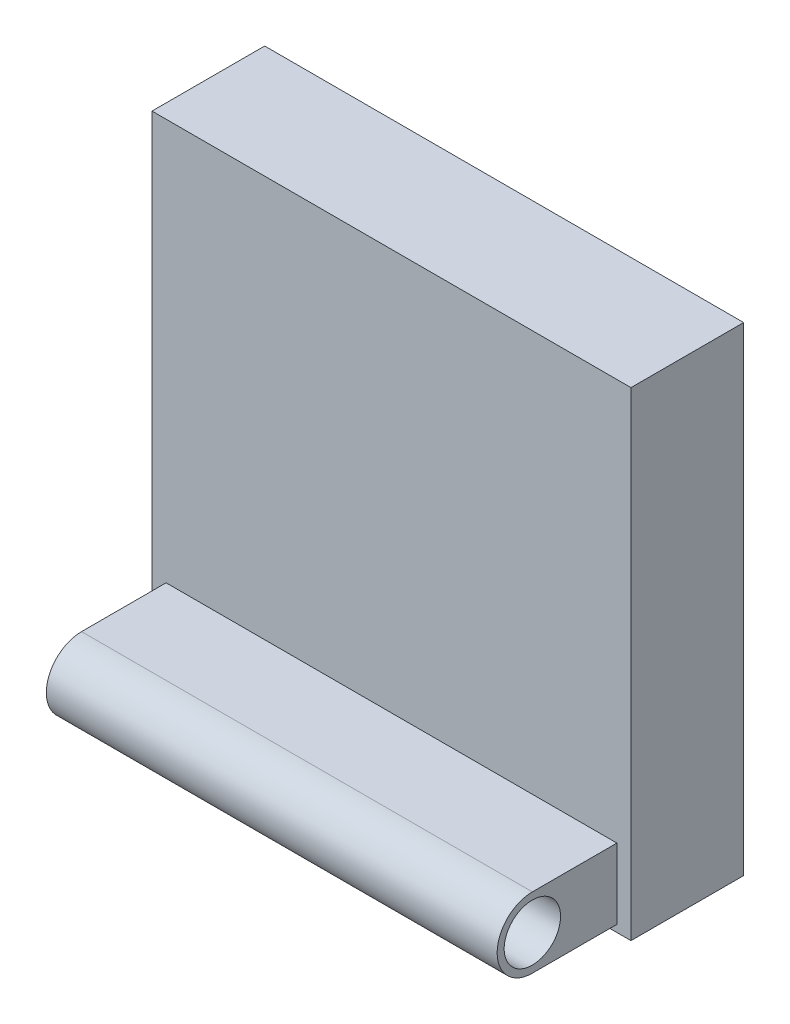
ISO-10303-21;
HEADER;
FILE_DESCRIPTION(('STEP AP214'),'2;1');
FILE_NAME('part.step','',(''),(''),'','','');
FILE_SCHEMA(('AUTOMOTIVE_DESIGN { 1 0 10303 214 1 1 1 1 }'));
ENDSEC;
DATA;
#1=APPLICATION_CONTEXT('core data for automotive mechanical design processes');
#2=APPLICATION_PROTOCOL_DEFINITION('international standard','automotive_design',2000,#1);
#3=PRODUCT_CONTEXT('',#1,'mechanical');
#4=PRODUCT('Part','Part','',(#3));
#5=PRODUCT_RELATED_PRODUCT_CATEGORY('part','',(#4));
#6=PRODUCT_DEFINITION_FORMATION('','',#4);
#7=PRODUCT_DEFINITION_CONTEXT('part definition',#1,'design');
#8=PRODUCT_DEFINITION('design','',#6,#7);
#9=PRODUCT_DEFINITION_SHAPE('','',#8);
#10=(LENGTH_UNIT() NAMED_UNIT(*) SI_UNIT(.MILLI.,.METRE.));
#11=(NAMED_UNIT(*) PLANE_ANGLE_UNIT() SI_UNIT($,.RADIAN.));
#12=(NAMED_UNIT(*) SI_UNIT($,.STERADIAN.) SOLID_ANGLE_UNIT());
#13=UNCERTAINTY_MEASURE_WITH_UNIT(LENGTH_MEASURE(1.E-05),#10,'distance_accuracy_value','');
#14=(GEOMETRIC_REPRESENTATION_CONTEXT(3) GLOBAL_UNCERTAINTY_ASSIGNED_CONTEXT((#13)) GLOBAL_UNIT_ASSIGNED_CONTEXT((#10,
#11,#12)) REPRESENTATION_CONTEXT('',''));
#15=CARTESIAN_POINT('',(0.,0.,0.));
#16=DIRECTION('',(0.,0.,1.));
#17=DIRECTION('',(1.,0.,0.));
#18=AXIS2_PLACEMENT_3D('',#15,#16,#17);
#19=CARTESIAN_POINT('',(0.,0.,8.));
#20=DIRECTION('',(0.,0.,0.999999999999999));
#21=DIRECTION('',(1.,0.,0.));
#22=AXIS2_PLACEMENT_3D('',#19,#20,#21);
#23=PLANE('',#22);
#24=DIRECTION('',(1.,0.,0.));
#25=VECTOR('',#24,1.);
#26=CARTESIAN_POINT('',(0.,34.,8.));
#27=LINE('',#26,#25);
#28=CARTESIAN_POINT('',(0.,34.,8.));
#29=VERTEX_POINT('',#28);
#30=CARTESIAN_POINT('',(34.,34.,8.));
#31=VERTEX_POINT('',#30);
#32=EDGE_CURVE('E155',#29,#31,#27,.T.);
#33=ORIENTED_EDGE('',*,*,#32,.F.);
#34=DIRECTION('',(0.,0.999999999999999,0.));
#35=VECTOR('',#34,1.);
#36=CARTESIAN_POINT('',(0.,0.,8.));
#37=LINE('',#36,#35);
#38=CARTESIAN_POINT('',(0.,0.,8.));
#39=VERTEX_POINT('',#38);
#40=EDGE_CURVE('E161',#39,#29,#37,.T.);
#41=ORIENTED_EDGE('',*,*,#40,.F.);
#42=DIRECTION('',(1.,0.,0.));
#43=VECTOR('',#42,1.);
#44=CARTESIAN_POINT('',(0.,0.,8.));
#45=LINE('',#44,#43);
#46=CARTESIAN_POINT('',(34.,0.,8.));
#47=VERTEX_POINT('',#46);
#48=EDGE_CURVE('E159',#39,#47,#45,.T.);
#49=ORIENTED_EDGE('',*,*,#48,.T.);
#50=DIRECTION('',(0.,0.999999999999999,0.));
#51=VECTOR('',#50,1.);
#52=CARTESIAN_POINT('',(34.,0.,8.));
#53=LINE('',#52,#51);
#54=EDGE_CURVE('E100',#47,#31,#53,.T.);
#55=ORIENTED_EDGE('',*,*,#54,.T.);
#56=EDGE_LOOP('',(#33,#41,#49,#55));
#57=FACE_BOUND('',#56,.T.);
#58=DIRECTION('',(0.,0.999999999999999,0.));
#59=VECTOR('',#58,1.);
#60=CARTESIAN_POINT('',(1.,5.5,8.));
#61=LINE('',#60,#59);
#62=CARTESIAN_POINT('',(1.,0.500000000000003,8.));
#63=VERTEX_POINT('',#62);
#64=CARTESIAN_POINT('',(1.,5.5,8.));
#65=VERTEX_POINT('',#64);
#66=EDGE_CURVE('E67',#63,#65,#61,.T.);
#67=ORIENTED_EDGE('',*,*,#66,.T.);
#68=DIRECTION('',(-1.,0.,0.));
#69=VECTOR('',#68,1.);
#70=CARTESIAN_POINT('',(33.,5.5,8.));
#71=LINE('',#70,#69);
#72=CARTESIAN_POINT('',(33.,5.5,8.));
#73=VERTEX_POINT('',#72);
#74=EDGE_CURVE('E128',#73,#65,#71,.T.);
#75=ORIENTED_EDGE('',*,*,#74,.F.);
#76=DIRECTION('',(0.,0.999999999999999,0.));
#77=VECTOR('',#76,1.);
#78=CARTESIAN_POINT('',(33.,5.5,8.));
#79=LINE('',#78,#77);
#80=CARTESIAN_POINT('',(33.,0.5,8.));
#81=VERTEX_POINT('',#80);
#82=EDGE_CURVE('E134',#81,#73,#79,.T.);
#83=ORIENTED_EDGE('',*,*,#82,.F.);
#84=DIRECTION('',(-1.,0.,0.));
#85=VECTOR('',#84,1.);
#86=CARTESIAN_POINT('',(33.,0.5,8.));
#87=LINE('',#86,#85);
#88=EDGE_CURVE('E261',#81,#63,#87,.T.);
#89=ORIENTED_EDGE('',*,*,#88,.T.);
#90=EDGE_LOOP('',(#67,#75,#83,#89));
#91=FACE_BOUND('',#90,.T.);
#92=ADVANCED_FACE('F50',(#57,#91),#23,.T.);
#93=CARTESIAN_POINT('',(0.,34.,8.));
#94=DIRECTION('',(0.,0.999999999999999,0.));
#95=DIRECTION('',(0.,0.,0.999999999999999));
#96=AXIS2_PLACEMENT_3D('',#93,#94,#95);
#97=PLANE('',#96);
#98=DIRECTION('',(1.,0.,0.));
#99=VECTOR('',#98,1.);
#100=CARTESIAN_POINT('',(0.,34.,0.));
#101=LINE('',#100,#99);
#102=CARTESIAN_POINT('',(0.,34.,0.));
#103=VERTEX_POINT('',#102);
#104=CARTESIAN_POINT('',(34.,34.,0.));
#105=VERTEX_POINT('',#104);
#106=EDGE_CURVE('E146',#103,#105,#101,.T.);
#107=ORIENTED_EDGE('',*,*,#106,.F.);
#108=DIRECTION('',(0.,0.,-0.999999999999999));
#109=VECTOR('',#108,1.);
#110=CARTESIAN_POINT('',(0.,34.,8.));
#111=LINE('',#110,#109);
#112=EDGE_CURVE('E13',#29,#103,#111,.T.);
#113=ORIENTED_EDGE('',*,*,#112,.F.);
#114=ORIENTED_EDGE('',*,*,#32,.T.);
#115=DIRECTION('',(0.,0.,-0.999999999999999));
#116=VECTOR('',#115,1.);
#117=CARTESIAN_POINT('',(34.,34.,8.));
#118=LINE('',#117,#116);
#119=EDGE_CURVE('E54',#31,#105,#118,.T.);
#120=ORIENTED_EDGE('',*,*,#119,.T.);
#121=EDGE_LOOP('',(#107,#113,#114,#120));
#122=FACE_BOUND('',#121,.T.);
#123=ADVANCED_FACE('F52',(#122),#97,.T.);
#124=CARTESIAN_POINT('',(0.,0.,8.));
#125=DIRECTION('',(-1.,0.,0.));
#126=DIRECTION('',(0.,-0.999999999999999,0.));
#127=AXIS2_PLACEMENT_3D('',#124,#125,#126);
#128=PLANE('',#127);
#129=DIRECTION('',(0.,0.999999999999999,0.));
#130=VECTOR('',#129,1.);
#131=CARTESIAN_POINT('',(0.,0.,0.));
#132=LINE('',#131,#130);
#133=CARTESIAN_POINT('',(0.,0.,0.));
#134=VERTEX_POINT('',#133);
#135=EDGE_CURVE('E157',#134,#103,#132,.T.);
#136=ORIENTED_EDGE('',*,*,#135,.F.);
#137=DIRECTION('',(0.,0.,-0.999999999999999));
#138=VECTOR('',#137,1.);
#139=CARTESIAN_POINT('',(0.,0.,8.));
#140=LINE('',#139,#138);
#141=EDGE_CURVE('E59',#39,#134,#140,.T.);
#142=ORIENTED_EDGE('',*,*,#141,.F.);
#143=ORIENTED_EDGE('',*,*,#40,.T.);
#144=ORIENTED_EDGE('',*,*,#112,.T.);
#145=EDGE_LOOP('',(#136,#142,#143,#144));
#146=FACE_BOUND('',#145,.T.);
#147=ADVANCED_FACE('F178',(#146),#128,.T.);
#148=CARTESIAN_POINT('',(0.,0.,8.));
#149=DIRECTION('',(0.,0.999999999999999,0.));
#150=DIRECTION('',(0.,0.,0.999999999999999));
#151=AXIS2_PLACEMENT_3D('',#148,#149,#150);
#152=PLANE('',#151);
#153=DIRECTION('',(1.,0.,0.));
#154=VECTOR('',#153,1.);
#155=CARTESIAN_POINT('',(0.,0.,0.));
#156=LINE('',#155,#154);
#157=CARTESIAN_POINT('',(34.,0.,0.));
#158=VERTEX_POINT('',#157);
#159=EDGE_CURVE('E165',#134,#158,#156,.T.);
#160=ORIENTED_EDGE('',*,*,#159,.T.);
#161=DIRECTION('',(0.,0.,-0.999999999999999));
#162=VECTOR('',#161,1.);
#163=CARTESIAN_POINT('',(34.,0.,8.));
#164=LINE('',#163,#162);
#165=EDGE_CURVE('E169',#47,#158,#164,.T.);
#166=ORIENTED_EDGE('',*,*,#165,.F.);
#167=ORIENTED_EDGE('',*,*,#48,.F.);
#168=ORIENTED_EDGE('',*,*,#141,.T.);
#169=EDGE_LOOP('',(#160,#166,#167,#168));
#170=FACE_BOUND('',#169,.T.);
#171=ADVANCED_FACE('F182',(#170),#152,.F.);
#172=CARTESIAN_POINT('',(34.,0.,8.));
#173=DIRECTION('',(-1.,0.,0.));
#174=DIRECTION('',(0.,-0.999999999999999,0.));
#175=AXIS2_PLACEMENT_3D('',#172,#173,#174);
#176=PLANE('',#175);
#177=DIRECTION('',(0.,0.999999999999999,0.));
#178=VECTOR('',#177,1.);
#179=CARTESIAN_POINT('',(34.,0.,0.));
#180=LINE('',#179,#178);
#181=EDGE_CURVE('E149',#158,#105,#180,.T.);
#182=ORIENTED_EDGE('',*,*,#181,.T.);
#183=ORIENTED_EDGE('',*,*,#119,.F.);
#184=ORIENTED_EDGE('',*,*,#54,.F.);
#185=ORIENTED_EDGE('',*,*,#165,.T.);
#186=EDGE_LOOP('',(#182,#183,#184,#185));
#187=FACE_BOUND('',#186,.T.);
#188=ADVANCED_FACE('F174',(#187),#176,.F.);
#189=CARTESIAN_POINT('',(0.,0.,0.));
#190=DIRECTION('',(0.,0.,0.999999999999999));
#191=DIRECTION('',(1.,0.,0.));
#192=AXIS2_PLACEMENT_3D('',#189,#190,#191);
#193=PLANE('',#192);
#194=ORIENTED_EDGE('',*,*,#106,.T.);
#195=ORIENTED_EDGE('',*,*,#181,.F.);
#196=ORIENTED_EDGE('',*,*,#159,.F.);
#197=ORIENTED_EDGE('',*,*,#135,.T.);
#198=EDGE_LOOP('',(#194,#195,#196,#197));
#199=FACE_BOUND('',#198,.T.);
#200=ADVANCED_FACE('F177',(#199),#193,.F.);
#201=CARTESIAN_POINT('',(33.,3.,14.));
#202=DIRECTION('',(1.,0.,0.));
#203=DIRECTION('',(0.,0.,-0.999999999999999));
#204=AXIS2_PLACEMENT_3D('',#201,#202,#203);
#205=PLANE('',#204);
#206=ORIENTED_EDGE('',*,*,#82,.T.);
#207=DIRECTION('',(0.,0.,0.999999999999999));
#208=VECTOR('',#207,1.);
#209=CARTESIAN_POINT('',(33.,5.5,8.));
#210=LINE('',#209,#208);
#211=CARTESIAN_POINT('',(33.,5.5,14.));
#212=VERTEX_POINT('',#211);
#213=EDGE_CURVE('E124',#73,#212,#210,.T.);
#214=ORIENTED_EDGE('',*,*,#213,.T.);
#215=CARTESIAN_POINT('',(33.,3.,14.));
#216=DIRECTION('',(1.,0.,0.));
#217=DIRECTION('',(0.,0.,-0.999999999999999));
#218=AXIS2_PLACEMENT_3D('',#215,#216,#217);
#219=CIRCLE('',#218,2.5);
#220=CARTESIAN_POINT('',(33.,0.500000000000003,14.));
#221=VERTEX_POINT('',#220);
#222=EDGE_CURVE('E133',#212,#221,#219,.T.);
#223=ORIENTED_EDGE('',*,*,#222,.T.);
#224=DIRECTION('',(0.,0.,-0.999999999999999));
#225=VECTOR('',#224,1.);
#226=CARTESIAN_POINT('',(33.,0.500000000000003,14.));
#227=LINE('',#226,#225);
#228=EDGE_CURVE('E140',#221,#81,#227,.T.);
#229=ORIENTED_EDGE('',*,*,#228,.T.);
#230=EDGE_LOOP('',(#206,#214,#223,#229));
#231=FACE_BOUND('',#230,.T.);
#232=CARTESIAN_POINT('',(33.,3.,14.));
#233=DIRECTION('',(1.,0.,0.));
#234=DIRECTION('',(0.,0.,-0.999999999999999));
#235=AXIS2_PLACEMENT_3D('',#232,#233,#234);
#236=CIRCLE('',#235,2.);
#237=CARTESIAN_POINT('',(33.,3.,12.));
#238=VERTEX_POINT('',#237);
#239=EDGE_CURVE('E251',#238,#238,#236,.T.);
#240=ORIENTED_EDGE('',*,*,#239,.F.);
#241=EDGE_LOOP('',(#240));
#242=FACE_BOUND('',#241,.T.);
#243=ADVANCED_FACE('F137',(#231,#242),#205,.T.);
#244=CARTESIAN_POINT('',(1.,3.,14.));
#245=DIRECTION('',(1.,0.,0.));
#246=DIRECTION('',(0.,0.,-0.999999999999999));
#247=AXIS2_PLACEMENT_3D('',#244,#245,#246);
#248=PLANE('',#247);
#249=ORIENTED_EDGE('',*,*,#66,.F.);
#250=DIRECTION('',(0.,0.,-0.999999999999999));
#251=VECTOR('',#250,1.);
#252=CARTESIAN_POINT('',(1.,0.5,14.));
#253=LINE('',#252,#251);
#254=CARTESIAN_POINT('',(1.,0.5,14.));
#255=VERTEX_POINT('',#254);
#256=EDGE_CURVE('E144',#255,#63,#253,.T.);
#257=ORIENTED_EDGE('',*,*,#256,.F.);
#258=CARTESIAN_POINT('',(1.,3.,14.));
#259=DIRECTION('',(1.,0.,0.));
#260=DIRECTION('',(0.,0.,-0.999999999999999));
#261=AXIS2_PLACEMENT_3D('',#258,#259,#260);
#262=CIRCLE('',#261,2.5);
#263=CARTESIAN_POINT('',(1.,5.5,14.));
#264=VERTEX_POINT('',#263);
#265=EDGE_CURVE('E265',#264,#255,#262,.T.);
#266=ORIENTED_EDGE('',*,*,#265,.F.);
#267=DIRECTION('',(0.,0.,0.999999999999999));
#268=VECTOR('',#267,1.);
#269=CARTESIAN_POINT('',(1.,5.5,8.));
#270=LINE('',#269,#268);
#271=EDGE_CURVE('E263',#65,#264,#270,.T.);
#272=ORIENTED_EDGE('',*,*,#271,.F.);
#273=EDGE_LOOP('',(#249,#257,#266,#272));
#274=FACE_BOUND('',#273,.T.);
#275=CARTESIAN_POINT('',(1.,3.,14.));
#276=DIRECTION('',(1.,0.,0.));
#277=DIRECTION('',(0.,0.,-0.999999999999999));
#278=AXIS2_PLACEMENT_3D('',#275,#276,#277);
#279=CIRCLE('',#278,2.);
#280=CARTESIAN_POINT('',(1.,3.,12.));
#281=VERTEX_POINT('',#280);
#282=EDGE_CURVE('E254',#281,#281,#279,.T.);
#283=ORIENTED_EDGE('',*,*,#282,.T.);
#284=EDGE_LOOP('',(#283));
#285=FACE_BOUND('',#284,.T.);
#286=ADVANCED_FACE('F211',(#274,#285),#248,.F.);
#287=CARTESIAN_POINT('',(33.,5.5,8.));
#288=DIRECTION('',(0.,-0.999999999999999,0.));
#289=DIRECTION('',(0.,0.,-0.999999999999999));
#290=AXIS2_PLACEMENT_3D('',#287,#288,#289);
#291=PLANE('',#290);
#292=ORIENTED_EDGE('',*,*,#271,.T.);
#293=DIRECTION('',(-1.,0.,0.));
#294=VECTOR('',#293,1.);
#295=CARTESIAN_POINT('',(33.,5.5,14.));
#296=LINE('',#295,#294);
#297=EDGE_CURVE('E130',#212,#264,#296,.T.);
#298=ORIENTED_EDGE('',*,*,#297,.F.);
#299=ORIENTED_EDGE('',*,*,#213,.F.);
#300=ORIENTED_EDGE('',*,*,#74,.T.);
#301=EDGE_LOOP('',(#292,#298,#299,#300));
#302=FACE_BOUND('',#301,.T.);
#303=ADVANCED_FACE('F126',(#302),#291,.F.);
#304=CARTESIAN_POINT('',(33.,3.,14.));
#305=DIRECTION('',(-1.,0.,0.));
#306=DIRECTION('',(0.,0.,0.999999999999999));
#307=AXIS2_PLACEMENT_3D('',#304,#305,#306);
#308=CYLINDRICAL_SURFACE('',#307,2.5);
#309=ORIENTED_EDGE('',*,*,#265,.T.);
#310=DIRECTION('',(-1.,0.,0.));
#311=VECTOR('',#310,1.);
#312=CARTESIAN_POINT('',(33.,0.500000000000003,14.));
#313=LINE('',#312,#311);
#314=EDGE_CURVE('E151',#221,#255,#313,.T.);
#315=ORIENTED_EDGE('',*,*,#314,.F.);
#316=ORIENTED_EDGE('',*,*,#222,.F.);
#317=ORIENTED_EDGE('',*,*,#297,.T.);
#318=EDGE_LOOP('',(#309,#315,#316,#317));
#319=FACE_BOUND('',#318,.T.);
#320=ADVANCED_FACE('F224',(#319),#308,.T.);
#321=CARTESIAN_POINT('',(33.,0.500000000000003,14.));
#322=DIRECTION('',(0.,0.999999999999999,0.));
#323=DIRECTION('',(0.,0.,0.999999999999999));
#324=AXIS2_PLACEMENT_3D('',#321,#322,#323);
#325=PLANE('',#324);
#326=ORIENTED_EDGE('',*,*,#256,.T.);
#327=ORIENTED_EDGE('',*,*,#88,.F.);
#328=ORIENTED_EDGE('',*,*,#228,.F.);
#329=ORIENTED_EDGE('',*,*,#314,.T.);
#330=EDGE_LOOP('',(#326,#327,#328,#329));
#331=FACE_BOUND('',#330,.T.);
#332=ADVANCED_FACE('F230',(#331),#325,.F.);
#333=CARTESIAN_POINT('',(33.,3.,14.));
#334=DIRECTION('',(-1.,0.,0.));
#335=DIRECTION('',(0.,0.,0.999999999999999));
#336=AXIS2_PLACEMENT_3D('',#333,#334,#335);
#337=CYLINDRICAL_SURFACE('',#336,2.);
#338=ORIENTED_EDGE('',*,*,#239,.T.);
#339=EDGE_LOOP('',(#338));
#340=FACE_BOUND('',#339,.T.);
#341=ORIENTED_EDGE('',*,*,#282,.F.);
#342=EDGE_LOOP('',(#341));
#343=FACE_BOUND('',#342,.T.);
#344=ADVANCED_FACE('F237',(#340,#343),#337,.F.);
#345=CLOSED_SHELL('',(#92,#123,#147,#171,#188,#200,#243,#286,#303,#320,#332,#344));
#346=MANIFOLD_SOLID_BREP('B2',#345);
#347=ADVANCED_BREP_SHAPE_REPRESENTATION('',(#18,#346),#14);
#348=SHAPE_DEFINITION_REPRESENTATION(#9,#347);
ENDSEC;
END-ISO-10303-21;
